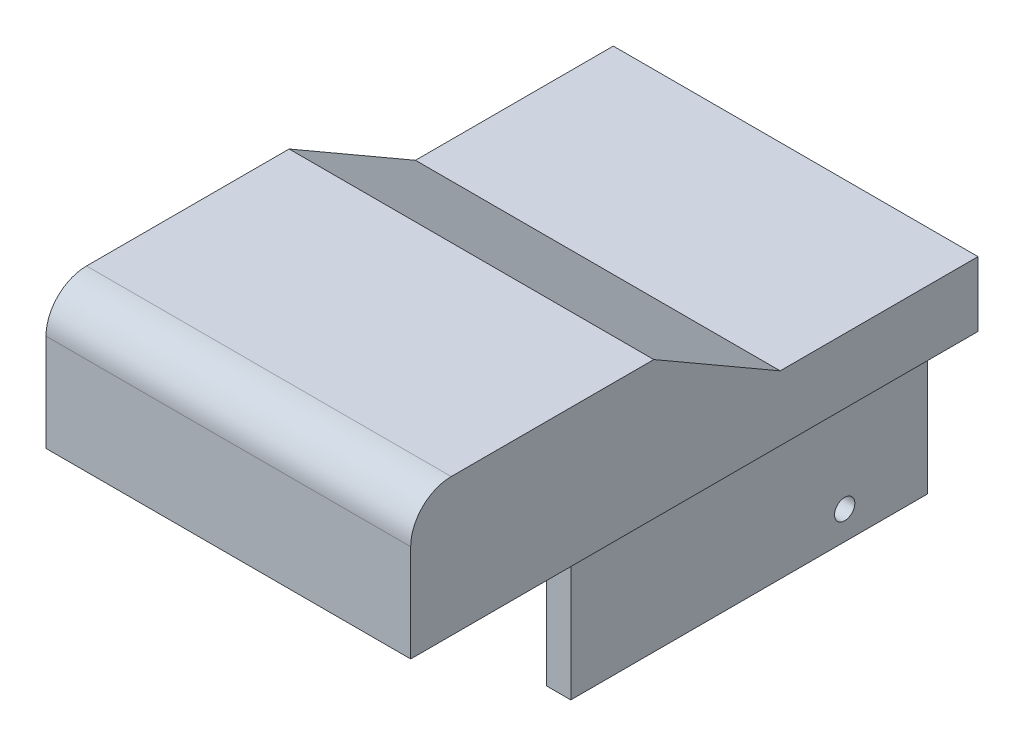
ISO-10303-21;
HEADER;
FILE_DESCRIPTION(('STEP AP214'),'2;1');
FILE_NAME('part.step','',(''),(''),'','','');
FILE_SCHEMA(('AUTOMOTIVE_DESIGN { 1 0 10303 214 1 1 1 1 }'));
ENDSEC;
DATA;
#1=APPLICATION_CONTEXT('core data for automotive mechanical design processes');
#2=APPLICATION_PROTOCOL_DEFINITION('international standard','automotive_design',2000,#1);
#3=PRODUCT_CONTEXT('',#1,'mechanical');
#4=PRODUCT('Part','Part','',(#3));
#5=PRODUCT_RELATED_PRODUCT_CATEGORY('part','',(#4));
#6=PRODUCT_DEFINITION_FORMATION('','',#4);
#7=PRODUCT_DEFINITION_CONTEXT('part definition',#1,'design');
#8=PRODUCT_DEFINITION('design','',#6,#7);
#9=PRODUCT_DEFINITION_SHAPE('','',#8);
#10=(LENGTH_UNIT() NAMED_UNIT(*) SI_UNIT(.MILLI.,.METRE.));
#11=(NAMED_UNIT(*) PLANE_ANGLE_UNIT() SI_UNIT($,.RADIAN.));
#12=(NAMED_UNIT(*) SI_UNIT($,.STERADIAN.) SOLID_ANGLE_UNIT());
#13=UNCERTAINTY_MEASURE_WITH_UNIT(LENGTH_MEASURE(1.E-05),#10,'distance_accuracy_value','');
#14=(GEOMETRIC_REPRESENTATION_CONTEXT(3) GLOBAL_UNCERTAINTY_ASSIGNED_CONTEXT((#13)) GLOBAL_UNIT_ASSIGNED_CONTEXT((#10,
#11,#12)) REPRESENTATION_CONTEXT('',''));
#15=CARTESIAN_POINT('',(0.,0.,0.));
#16=DIRECTION('',(0.,0.,1.));
#17=DIRECTION('',(1.,0.,0.));
#18=AXIS2_PLACEMENT_3D('',#15,#16,#17);
#19=CARTESIAN_POINT('',(22.5,-17.,-63.3184572681201));
#20=DIRECTION('',(0.,1.,0.));
#21=DIRECTION('',(0.,0.,1.));
#22=AXIS2_PLACEMENT_3D('',#19,#20,#21);
#23=PLANE('',#22);
#24=DIRECTION('',(0.,0.,1.));
#25=VECTOR('',#24,1.);
#26=CARTESIAN_POINT('',(-13.25,-17.,-70.));
#27=LINE('',#26,#25);
#28=CARTESIAN_POINT('',(-13.25,-17.,-70.));
#29=VERTEX_POINT('',#28);
#30=CARTESIAN_POINT('',(-13.25,-17.,-26.));
#31=VERTEX_POINT('',#30);
#32=EDGE_CURVE('E281',#29,#31,#27,.T.);
#33=ORIENTED_EDGE('',*,*,#32,.F.);
#34=DIRECTION('',(-1.,0.,0.));
#35=VECTOR('',#34,1.);
#36=CARTESIAN_POINT('',(22.5,-17.,-70.));
#37=LINE('',#36,#35);
#38=CARTESIAN_POINT('',(13.25,-17.,-70.));
#39=VERTEX_POINT('',#38);
#40=EDGE_CURVE('E163',#39,#29,#37,.T.);
#41=ORIENTED_EDGE('',*,*,#40,.F.);
#42=DIRECTION('',(0.,0.,-1.));
#43=VECTOR('',#42,1.);
#44=CARTESIAN_POINT('',(13.25,-17.,-70.));
#45=LINE('',#44,#43);
#46=CARTESIAN_POINT('',(13.25,-17.,-26.));
#47=VERTEX_POINT('',#46);
#48=EDGE_CURVE('E58',#47,#39,#45,.T.);
#49=ORIENTED_EDGE('',*,*,#48,.F.);
#50=DIRECTION('',(-1.,0.,0.));
#51=VECTOR('',#50,1.);
#52=CARTESIAN_POINT('',(13.25,-17.,-26.));
#53=LINE('',#52,#51);
#54=CARTESIAN_POINT('',(16.25,-17.,-26.));
#55=VERTEX_POINT('',#54);
#56=EDGE_CURVE('E175',#55,#47,#53,.T.);
#57=ORIENTED_EDGE('',*,*,#56,.F.);
#58=DIRECTION('',(0.,0.,1.));
#59=VECTOR('',#58,1.);
#60=CARTESIAN_POINT('',(16.25,-17.,-70.));
#61=LINE('',#60,#59);
#62=CARTESIAN_POINT('',(16.25,-17.,-70.));
#63=VERTEX_POINT('',#62);
#64=EDGE_CURVE('E165',#63,#55,#61,.T.);
#65=ORIENTED_EDGE('',*,*,#64,.F.);
#66=CARTESIAN_POINT('',(22.5,-17.,-70.));
#67=VERTEX_POINT('',#66);
#68=EDGE_CURVE('E234',#67,#63,#37,.T.);
#69=ORIENTED_EDGE('',*,*,#68,.F.);
#70=DIRECTION('',(0.,0.,-1.));
#71=VECTOR('',#70,1.);
#72=CARTESIAN_POINT('',(22.5,-17.,-63.3184572681201));
#73=LINE('',#72,#71);
#74=CARTESIAN_POINT('',(22.5,-17.,0.));
#75=VERTEX_POINT('',#74);
#76=EDGE_CURVE('E206',#75,#67,#73,.T.);
#77=ORIENTED_EDGE('',*,*,#76,.F.);
#78=DIRECTION('',(-1.,0.,0.));
#79=VECTOR('',#78,1.);
#80=CARTESIAN_POINT('',(22.5,-17.,0.));
#81=LINE('',#80,#79);
#82=CARTESIAN_POINT('',(-22.5,-17.,0.));
#83=VERTEX_POINT('',#82);
#84=EDGE_CURVE('E237',#75,#83,#81,.T.);
#85=ORIENTED_EDGE('',*,*,#84,.T.);
#86=DIRECTION('',(0.,0.,-1.));
#87=VECTOR('',#86,1.);
#88=CARTESIAN_POINT('',(-22.5,-17.,-63.3184572681201));
#89=LINE('',#88,#87);
#90=CARTESIAN_POINT('',(-22.5,-17.,-70.));
#91=VERTEX_POINT('',#90);
#92=EDGE_CURVE('E222',#83,#91,#89,.T.);
#93=ORIENTED_EDGE('',*,*,#92,.T.);
#94=CARTESIAN_POINT('',(-16.25,-17.,-70.));
#95=VERTEX_POINT('',#94);
#96=EDGE_CURVE('E233',#95,#91,#37,.T.);
#97=ORIENTED_EDGE('',*,*,#96,.F.);
#98=DIRECTION('',(0.,0.,-1.));
#99=VECTOR('',#98,1.);
#100=CARTESIAN_POINT('',(-16.25,-17.,-70.));
#101=LINE('',#100,#99);
#102=CARTESIAN_POINT('',(-16.25,-17.,-26.));
#103=VERTEX_POINT('',#102);
#104=EDGE_CURVE('E158',#103,#95,#101,.T.);
#105=ORIENTED_EDGE('',*,*,#104,.F.);
#106=DIRECTION('',(-1.,0.,0.));
#107=VECTOR('',#106,1.);
#108=CARTESIAN_POINT('',(-13.25,-17.,-26.));
#109=LINE('',#108,#107);
#110=EDGE_CURVE('E277',#31,#103,#109,.T.);
#111=ORIENTED_EDGE('',*,*,#110,.F.);
#112=EDGE_LOOP('',(#33,#41,#49,#57,#65,#69,#77,#85,#93,#97,#105,#111));
#113=FACE_BOUND('',#112,.T.);
#114=ADVANCED_FACE('F35',(#113),#23,.F.);
#115=CARTESIAN_POINT('',(22.5,0.,-30.));
#116=DIRECTION('',(0.,-0.866025403784442,0.499999999999994));
#117=DIRECTION('',(0.,-0.499999999999995,-0.866025403784442));
#118=AXIS2_PLACEMENT_3D('',#115,#116,#117);
#119=PLANE('',#118);
#120=DIRECTION('',(0.,0.499999999999994,0.866025403784442));
#121=VECTOR('',#120,1.);
#122=CARTESIAN_POINT('',(-22.5,0.,-30.));
#123=LINE('',#122,#121);
#124=CARTESIAN_POINT('',(-22.5,-9.,-45.5884572681201));
#125=VERTEX_POINT('',#124);
#126=CARTESIAN_POINT('',(-22.5,0.,-30.));
#127=VERTEX_POINT('',#126);
#128=EDGE_CURVE('E195',#125,#127,#123,.T.);
#129=ORIENTED_EDGE('',*,*,#128,.T.);
#130=DIRECTION('',(-1.,0.,0.));
#131=VECTOR('',#130,1.);
#132=CARTESIAN_POINT('',(22.5,0.,-30.));
#133=LINE('',#132,#131);
#134=CARTESIAN_POINT('',(22.5,0.,-30.));
#135=VERTEX_POINT('',#134);
#136=EDGE_CURVE('E11',#135,#127,#133,.T.);
#137=ORIENTED_EDGE('',*,*,#136,.F.);
#138=DIRECTION('',(0.,0.499999999999994,0.866025403784442));
#139=VECTOR('',#138,1.);
#140=CARTESIAN_POINT('',(22.5,0.,-30.));
#141=LINE('',#140,#139);
#142=CARTESIAN_POINT('',(22.5,-9.,-45.5884572681201));
#143=VERTEX_POINT('',#142);
#144=EDGE_CURVE('E196',#143,#135,#141,.T.);
#145=ORIENTED_EDGE('',*,*,#144,.F.);
#146=DIRECTION('',(-1.,0.,0.));
#147=VECTOR('',#146,1.);
#148=CARTESIAN_POINT('',(22.5,-9.,-45.5884572681201));
#149=LINE('',#148,#147);
#150=EDGE_CURVE('E212',#143,#125,#149,.T.);
#151=ORIENTED_EDGE('',*,*,#150,.T.);
#152=EDGE_LOOP('',(#129,#137,#145,#151));
#153=FACE_BOUND('',#152,.T.);
#154=ADVANCED_FACE('F37',(#153),#119,.F.);
#155=CARTESIAN_POINT('',(22.5,0.,-5.00000000000004));
#156=DIRECTION('',(0.,-1.,0.));
#157=DIRECTION('',(0.,0.,-1.));
#158=AXIS2_PLACEMENT_3D('',#155,#156,#157);
#159=PLANE('',#158);
#160=DIRECTION('',(0.,0.,1.));
#161=VECTOR('',#160,1.);
#162=CARTESIAN_POINT('',(-22.5,0.,-5.00000000000004));
#163=LINE('',#162,#161);
#164=CARTESIAN_POINT('',(-22.5,0.,-5.00000000000004));
#165=VERTEX_POINT('',#164);
#166=EDGE_CURVE('E215',#127,#165,#163,.T.);
#167=ORIENTED_EDGE('',*,*,#166,.T.);
#168=DIRECTION('',(-1.,0.,0.));
#169=VECTOR('',#168,1.);
#170=CARTESIAN_POINT('',(22.5,0.,-5.00000000000004));
#171=LINE('',#170,#169);
#172=CARTESIAN_POINT('',(22.5,0.,-5.00000000000004));
#173=VERTEX_POINT('',#172);
#174=EDGE_CURVE('E43',#173,#165,#171,.T.);
#175=ORIENTED_EDGE('',*,*,#174,.F.);
#176=DIRECTION('',(0.,0.,1.));
#177=VECTOR('',#176,1.);
#178=CARTESIAN_POINT('',(22.5,0.,-5.00000000000004));
#179=LINE('',#178,#177);
#180=EDGE_CURVE('E199',#135,#173,#179,.T.);
#181=ORIENTED_EDGE('',*,*,#180,.F.);
#182=ORIENTED_EDGE('',*,*,#136,.T.);
#183=EDGE_LOOP('',(#167,#175,#181,#182));
#184=FACE_BOUND('',#183,.T.);
#185=ADVANCED_FACE('F268',(#184),#159,.F.);
#186=CARTESIAN_POINT('',(22.5,-5.,-5.));
#187=DIRECTION('',(-1.,0.,0.));
#188=DIRECTION('',(0.,0.,1.));
#189=AXIS2_PLACEMENT_3D('',#186,#187,#188);
#190=CYLINDRICAL_SURFACE('',#189,5.);
#191=CARTESIAN_POINT('',(-22.5,-5.,-5.));
#192=DIRECTION('',(1.,0.,0.));
#193=DIRECTION('',(0.,0.,-1.));
#194=AXIS2_PLACEMENT_3D('',#191,#192,#193);
#195=CIRCLE('',#194,5.);
#196=CARTESIAN_POINT('',(-22.5,-5.00000000000003,0.));
#197=VERTEX_POINT('',#196);
#198=EDGE_CURVE('E217',#165,#197,#195,.T.);
#199=ORIENTED_EDGE('',*,*,#198,.T.);
#200=DIRECTION('',(-1.,0.,0.));
#201=VECTOR('',#200,1.);
#202=CARTESIAN_POINT('',(22.5,-5.00000000000003,0.));
#203=LINE('',#202,#201);
#204=CARTESIAN_POINT('',(22.5,-5.00000000000003,0.));
#205=VERTEX_POINT('',#204);
#206=EDGE_CURVE('E240',#205,#197,#203,.T.);
#207=ORIENTED_EDGE('',*,*,#206,.F.);
#208=CARTESIAN_POINT('',(22.5,-5.,-5.));
#209=DIRECTION('',(1.,0.,0.));
#210=DIRECTION('',(0.,0.,-1.));
#211=AXIS2_PLACEMENT_3D('',#208,#209,#210);
#212=CIRCLE('',#211,5.);
#213=EDGE_CURVE('E202',#173,#205,#212,.T.);
#214=ORIENTED_EDGE('',*,*,#213,.F.);
#215=ORIENTED_EDGE('',*,*,#174,.T.);
#216=EDGE_LOOP('',(#199,#207,#214,#215));
#217=FACE_BOUND('',#216,.T.);
#218=ADVANCED_FACE('F247',(#217),#190,.T.);
#219=CARTESIAN_POINT('',(22.5,-17.,0.));
#220=DIRECTION('',(0.,0.,-1.));
#221=DIRECTION('',(-1.,0.,0.));
#222=AXIS2_PLACEMENT_3D('',#219,#220,#221);
#223=PLANE('',#222);
#224=DIRECTION('',(0.,-1.,0.));
#225=VECTOR('',#224,1.);
#226=CARTESIAN_POINT('',(-22.5,-17.,0.));
#227=LINE('',#226,#225);
#228=EDGE_CURVE('E219',#197,#83,#227,.T.);
#229=ORIENTED_EDGE('',*,*,#228,.T.);
#230=ORIENTED_EDGE('',*,*,#84,.F.);
#231=DIRECTION('',(0.,-1.,0.));
#232=VECTOR('',#231,1.);
#233=CARTESIAN_POINT('',(22.5,-17.,0.));
#234=LINE('',#233,#232);
#235=EDGE_CURVE('E204',#205,#75,#234,.T.);
#236=ORIENTED_EDGE('',*,*,#235,.F.);
#237=ORIENTED_EDGE('',*,*,#206,.T.);
#238=EDGE_LOOP('',(#229,#230,#236,#237));
#239=FACE_BOUND('',#238,.T.);
#240=ADVANCED_FACE('F257',(#239),#223,.F.);
#241=CARTESIAN_POINT('',(22.5,-17.,-70.));
#242=DIRECTION('',(0.,0.,1.));
#243=DIRECTION('',(1.,0.,0.));
#244=AXIS2_PLACEMENT_3D('',#241,#242,#243);
#245=PLANE('',#244);
#246=DIRECTION('',(0.,1.,0.));
#247=VECTOR('',#246,1.);
#248=CARTESIAN_POINT('',(-22.5,-17.,-70.));
#249=LINE('',#248,#247);
#250=CARTESIAN_POINT('',(-22.5,-8.99999999999999,-70.));
#251=VERTEX_POINT('',#250);
#252=EDGE_CURVE('E225',#91,#251,#249,.T.);
#253=ORIENTED_EDGE('',*,*,#252,.T.);
#254=DIRECTION('',(-1.,0.,0.));
#255=VECTOR('',#254,1.);
#256=CARTESIAN_POINT('',(22.5,-8.99999999999999,-70.));
#257=LINE('',#256,#255);
#258=CARTESIAN_POINT('',(22.5,-8.99999999999999,-70.));
#259=VERTEX_POINT('',#258);
#260=EDGE_CURVE('E230',#259,#251,#257,.T.);
#261=ORIENTED_EDGE('',*,*,#260,.F.);
#262=DIRECTION('',(0.,1.,0.));
#263=VECTOR('',#262,1.);
#264=CARTESIAN_POINT('',(22.5,-17.,-70.));
#265=LINE('',#264,#263);
#266=EDGE_CURVE('E208',#67,#259,#265,.T.);
#267=ORIENTED_EDGE('',*,*,#266,.F.);
#268=ORIENTED_EDGE('',*,*,#68,.T.);
#269=DIRECTION('',(0.,1.,0.));
#270=VECTOR('',#269,1.);
#271=CARTESIAN_POINT('',(16.25,-37.5,-70.));
#272=LINE('',#271,#270);
#273=CARTESIAN_POINT('',(16.25,-37.5,-70.));
#274=VERTEX_POINT('',#273);
#275=EDGE_CURVE('E190',#274,#63,#272,.T.);
#276=ORIENTED_EDGE('',*,*,#275,.F.);
#277=DIRECTION('',(1.,0.,0.));
#278=VECTOR('',#277,1.);
#279=CARTESIAN_POINT('',(13.25,-37.5,-70.));
#280=LINE('',#279,#278);
#281=CARTESIAN_POINT('',(13.25,-37.5,-70.));
#282=VERTEX_POINT('',#281);
#283=EDGE_CURVE('E174',#282,#274,#280,.T.);
#284=ORIENTED_EDGE('',*,*,#283,.F.);
#285=DIRECTION('',(0.,1.,0.));
#286=VECTOR('',#285,1.);
#287=CARTESIAN_POINT('',(13.25,-37.5,-70.));
#288=LINE('',#287,#286);
#289=EDGE_CURVE('E193',#282,#39,#288,.T.);
#290=ORIENTED_EDGE('',*,*,#289,.T.);
#291=ORIENTED_EDGE('',*,*,#40,.T.);
#292=DIRECTION('',(0.,1.,0.));
#293=VECTOR('',#292,1.);
#294=CARTESIAN_POINT('',(-13.25,-37.5,-70.));
#295=LINE('',#294,#293);
#296=CARTESIAN_POINT('',(-13.25,-37.5,-70.));
#297=VERTEX_POINT('',#296);
#298=EDGE_CURVE('E146',#297,#29,#295,.T.);
#299=ORIENTED_EDGE('',*,*,#298,.F.);
#300=DIRECTION('',(1.,0.,0.));
#301=VECTOR('',#300,1.);
#302=CARTESIAN_POINT('',(-13.25,-37.5,-70.));
#303=LINE('',#302,#301);
#304=CARTESIAN_POINT('',(-16.25,-37.5,-70.));
#305=VERTEX_POINT('',#304);
#306=EDGE_CURVE('E153',#305,#297,#303,.T.);
#307=ORIENTED_EDGE('',*,*,#306,.F.);
#308=DIRECTION('',(0.,1.,0.));
#309=VECTOR('',#308,1.);
#310=CARTESIAN_POINT('',(-16.25,-37.5,-70.));
#311=LINE('',#310,#309);
#312=EDGE_CURVE('E50',#305,#95,#311,.T.);
#313=ORIENTED_EDGE('',*,*,#312,.T.);
#314=ORIENTED_EDGE('',*,*,#96,.T.);
#315=EDGE_LOOP('',(#253,#261,#267,#268,#276,#284,#290,#291,#299,#307,#313,#314));
#316=FACE_BOUND('',#315,.T.);
#317=ADVANCED_FACE('F161',(#316),#245,.F.);
#318=CARTESIAN_POINT('',(22.5,-8.99999999999999,-70.));
#319=DIRECTION('',(0.,-1.,0.));
#320=DIRECTION('',(0.,0.,-1.));
#321=AXIS2_PLACEMENT_3D('',#318,#319,#320);
#322=PLANE('',#321);
#323=DIRECTION('',(0.,0.,1.));
#324=VECTOR('',#323,1.);
#325=CARTESIAN_POINT('',(-22.5,-8.99999999999999,-70.));
#326=LINE('',#325,#324);
#327=EDGE_CURVE('E200',#251,#125,#326,.T.);
#328=ORIENTED_EDGE('',*,*,#327,.T.);
#329=ORIENTED_EDGE('',*,*,#150,.F.);
#330=DIRECTION('',(0.,0.,1.));
#331=VECTOR('',#330,1.);
#332=CARTESIAN_POINT('',(22.5,-8.99999999999999,-70.));
#333=LINE('',#332,#331);
#334=EDGE_CURVE('E210',#259,#143,#333,.T.);
#335=ORIENTED_EDGE('',*,*,#334,.F.);
#336=ORIENTED_EDGE('',*,*,#260,.T.);
#337=EDGE_LOOP('',(#328,#329,#335,#336));
#338=FACE_BOUND('',#337,.T.);
#339=ADVANCED_FACE('F273',(#338),#322,.F.);
#340=CARTESIAN_POINT('',(22.5,-5.,-5.));
#341=DIRECTION('',(1.,0.,0.));
#342=DIRECTION('',(0.,0.,-1.));
#343=AXIS2_PLACEMENT_3D('',#340,#341,#342);
#344=PLANE('',#343);
#345=ORIENTED_EDGE('',*,*,#144,.T.);
#346=ORIENTED_EDGE('',*,*,#180,.T.);
#347=ORIENTED_EDGE('',*,*,#213,.T.);
#348=ORIENTED_EDGE('',*,*,#235,.T.);
#349=ORIENTED_EDGE('',*,*,#76,.T.);
#350=ORIENTED_EDGE('',*,*,#266,.T.);
#351=ORIENTED_EDGE('',*,*,#334,.T.);
#352=EDGE_LOOP('',(#345,#346,#347,#348,#349,#350,#351));
#353=FACE_BOUND('',#352,.T.);
#354=ADVANCED_FACE('F264',(#353),#344,.T.);
#355=CARTESIAN_POINT('',(-22.5,-5.,-5.));
#356=DIRECTION('',(1.,0.,0.));
#357=DIRECTION('',(0.,0.,-1.));
#358=AXIS2_PLACEMENT_3D('',#355,#356,#357);
#359=PLANE('',#358);
#360=ORIENTED_EDGE('',*,*,#128,.F.);
#361=ORIENTED_EDGE('',*,*,#327,.F.);
#362=ORIENTED_EDGE('',*,*,#252,.F.);
#363=ORIENTED_EDGE('',*,*,#92,.F.);
#364=ORIENTED_EDGE('',*,*,#228,.F.);
#365=ORIENTED_EDGE('',*,*,#198,.F.);
#366=ORIENTED_EDGE('',*,*,#166,.F.);
#367=EDGE_LOOP('',(#360,#361,#362,#363,#364,#365,#366));
#368=FACE_BOUND('',#367,.T.);
#369=ADVANCED_FACE('F253',(#368),#359,.F.);
#370=CARTESIAN_POINT('',(13.25,-37.5,-70.));
#371=DIRECTION('',(1.,0.,0.));
#372=DIRECTION('',(0.,0.,-1.));
#373=AXIS2_PLACEMENT_3D('',#370,#371,#372);
#374=PLANE('',#373);
#375=CARTESIAN_POINT('',(13.25,-20.5,-39.5));
#376=DIRECTION('',(1.,0.,0.));
#377=DIRECTION('',(0.,0.,-1.));
#378=AXIS2_PLACEMENT_3D('',#375,#376,#377);
#379=CIRCLE('',#378,1.25);
#380=CARTESIAN_POINT('',(13.25,-20.5,-40.75));
#381=VERTEX_POINT('',#380);
#382=EDGE_CURVE('E306',#381,#381,#379,.T.);
#383=ORIENTED_EDGE('',*,*,#382,.T.);
#384=EDGE_LOOP('',(#383));
#385=FACE_BOUND('',#384,.T.);
#386=CARTESIAN_POINT('',(13.25,-34.,-59.8));
#387=DIRECTION('',(1.,0.,0.));
#388=DIRECTION('',(0.,0.,-1.));
#389=AXIS2_PLACEMENT_3D('',#386,#387,#388);
#390=CIRCLE('',#389,1.25);
#391=CARTESIAN_POINT('',(13.25,-34.,-61.05));
#392=VERTEX_POINT('',#391);
#393=EDGE_CURVE('E291',#392,#392,#390,.T.);
#394=ORIENTED_EDGE('',*,*,#393,.T.);
#395=EDGE_LOOP('',(#394));
#396=FACE_BOUND('',#395,.T.);
#397=ORIENTED_EDGE('',*,*,#48,.T.);
#398=ORIENTED_EDGE('',*,*,#289,.F.);
#399=DIRECTION('',(0.,0.,-1.));
#400=VECTOR('',#399,1.);
#401=CARTESIAN_POINT('',(13.25,-37.5,-70.));
#402=LINE('',#401,#400);
#403=CARTESIAN_POINT('',(13.25,-37.5,-26.));
#404=VERTEX_POINT('',#403);
#405=EDGE_CURVE('E171',#404,#282,#402,.T.);
#406=ORIENTED_EDGE('',*,*,#405,.F.);
#407=DIRECTION('',(0.,1.,0.));
#408=VECTOR('',#407,1.);
#409=CARTESIAN_POINT('',(13.25,-37.5,-26.));
#410=LINE('',#409,#408);
#411=EDGE_CURVE('E180',#404,#47,#410,.T.);
#412=ORIENTED_EDGE('',*,*,#411,.T.);
#413=EDGE_LOOP('',(#397,#398,#406,#412));
#414=FACE_BOUND('',#413,.T.);
#415=ADVANCED_FACE('F393',(#385,#396,#414),#374,.F.);
#416=CARTESIAN_POINT('',(16.25,-37.5,-70.));
#417=DIRECTION('',(-1.,0.,0.));
#418=DIRECTION('',(0.,0.,1.));
#419=AXIS2_PLACEMENT_3D('',#416,#417,#418);
#420=PLANE('',#419);
#421=CARTESIAN_POINT('',(16.25,-20.5,-39.5));
#422=DIRECTION('',(-1.,0.,0.));
#423=DIRECTION('',(0.,0.,1.));
#424=AXIS2_PLACEMENT_3D('',#421,#422,#423);
#425=CIRCLE('',#424,1.25);
#426=CARTESIAN_POINT('',(16.25,-20.5,-38.25));
#427=VERTEX_POINT('',#426);
#428=EDGE_CURVE('E309',#427,#427,#425,.T.);
#429=ORIENTED_EDGE('',*,*,#428,.T.);
#430=EDGE_LOOP('',(#429));
#431=FACE_BOUND('',#430,.T.);
#432=CARTESIAN_POINT('',(16.25,-34.,-59.8));
#433=DIRECTION('',(-1.,0.,0.));
#434=DIRECTION('',(0.,0.,1.));
#435=AXIS2_PLACEMENT_3D('',#432,#433,#434);
#436=CIRCLE('',#435,1.25);
#437=CARTESIAN_POINT('',(16.25,-34.,-58.55));
#438=VERTEX_POINT('',#437);
#439=EDGE_CURVE('E293',#438,#438,#436,.T.);
#440=ORIENTED_EDGE('',*,*,#439,.T.);
#441=EDGE_LOOP('',(#440));
#442=FACE_BOUND('',#441,.T.);
#443=ORIENTED_EDGE('',*,*,#64,.T.);
#444=DIRECTION('',(0.,1.,0.));
#445=VECTOR('',#444,1.);
#446=CARTESIAN_POINT('',(16.25,-37.5,-26.));
#447=LINE('',#446,#445);
#448=CARTESIAN_POINT('',(16.25,-37.5,-26.));
#449=VERTEX_POINT('',#448);
#450=EDGE_CURVE('E187',#449,#55,#447,.T.);
#451=ORIENTED_EDGE('',*,*,#450,.F.);
#452=DIRECTION('',(0.,0.,1.));
#453=VECTOR('',#452,1.);
#454=CARTESIAN_POINT('',(16.25,-37.5,-70.));
#455=LINE('',#454,#453);
#456=EDGE_CURVE('E177',#274,#449,#455,.T.);
#457=ORIENTED_EDGE('',*,*,#456,.F.);
#458=ORIENTED_EDGE('',*,*,#275,.T.);
#459=EDGE_LOOP('',(#443,#451,#457,#458));
#460=FACE_BOUND('',#459,.T.);
#461=ADVANCED_FACE('F400',(#431,#442,#460),#420,.F.);
#462=CARTESIAN_POINT('',(13.25,-37.5,-26.));
#463=DIRECTION('',(0.,0.,-1.));
#464=DIRECTION('',(-1.,0.,0.));
#465=AXIS2_PLACEMENT_3D('',#462,#463,#464);
#466=PLANE('',#465);
#467=ORIENTED_EDGE('',*,*,#56,.T.);
#468=ORIENTED_EDGE('',*,*,#411,.F.);
#469=DIRECTION('',(-1.,0.,0.));
#470=VECTOR('',#469,1.);
#471=CARTESIAN_POINT('',(13.25,-37.5,-26.));
#472=LINE('',#471,#470);
#473=EDGE_CURVE('E179',#449,#404,#472,.T.);
#474=ORIENTED_EDGE('',*,*,#473,.F.);
#475=ORIENTED_EDGE('',*,*,#450,.T.);
#476=EDGE_LOOP('',(#467,#468,#474,#475));
#477=FACE_BOUND('',#476,.T.);
#478=ADVANCED_FACE('F343',(#477),#466,.F.);
#479=CARTESIAN_POINT('',(0.,-37.5,0.));
#480=DIRECTION('',(0.,1.,0.));
#481=DIRECTION('',(0.,0.,1.));
#482=AXIS2_PLACEMENT_3D('',#479,#480,#481);
#483=PLANE('',#482);
#484=ORIENTED_EDGE('',*,*,#405,.T.);
#485=ORIENTED_EDGE('',*,*,#283,.T.);
#486=ORIENTED_EDGE('',*,*,#456,.T.);
#487=ORIENTED_EDGE('',*,*,#473,.T.);
#488=EDGE_LOOP('',(#484,#485,#486,#487));
#489=FACE_BOUND('',#488,.T.);
#490=ADVANCED_FACE('F335',(#489),#483,.F.);
#491=CARTESIAN_POINT('',(-13.25,-37.5,-70.));
#492=DIRECTION('',(-1.,0.,0.));
#493=DIRECTION('',(0.,0.,1.));
#494=AXIS2_PLACEMENT_3D('',#491,#492,#493);
#495=PLANE('',#494);
#496=CARTESIAN_POINT('',(-13.25,-20.5,-39.5));
#497=DIRECTION('',(-1.,0.,0.));
#498=DIRECTION('',(0.,0.,1.));
#499=AXIS2_PLACEMENT_3D('',#496,#497,#498);
#500=CIRCLE('',#499,1.25);
#501=CARTESIAN_POINT('',(-13.25,-20.5,-38.25));
#502=VERTEX_POINT('',#501);
#503=EDGE_CURVE('E312',#502,#502,#500,.T.);
#504=ORIENTED_EDGE('',*,*,#503,.T.);
#505=EDGE_LOOP('',(#504));
#506=FACE_BOUND('',#505,.T.);
#507=CARTESIAN_POINT('',(-13.25,-34.,-59.8));
#508=DIRECTION('',(-1.,0.,0.));
#509=DIRECTION('',(0.,0.,1.));
#510=AXIS2_PLACEMENT_3D('',#507,#508,#509);
#511=CIRCLE('',#510,1.25);
#512=CARTESIAN_POINT('',(-13.25,-34.,-58.55));
#513=VERTEX_POINT('',#512);
#514=EDGE_CURVE('E298',#513,#513,#511,.T.);
#515=ORIENTED_EDGE('',*,*,#514,.T.);
#516=EDGE_LOOP('',(#515));
#517=FACE_BOUND('',#516,.T.);
#518=ORIENTED_EDGE('',*,*,#32,.T.);
#519=DIRECTION('',(0.,1.,0.));
#520=VECTOR('',#519,1.);
#521=CARTESIAN_POINT('',(-13.25,-37.5,-26.));
#522=LINE('',#521,#520);
#523=CARTESIAN_POINT('',(-13.25,-37.5,-26.));
#524=VERTEX_POINT('',#523);
#525=EDGE_CURVE('E149',#524,#31,#522,.T.);
#526=ORIENTED_EDGE('',*,*,#525,.F.);
#527=DIRECTION('',(0.,0.,1.));
#528=VECTOR('',#527,1.);
#529=CARTESIAN_POINT('',(-13.25,-37.5,-70.));
#530=LINE('',#529,#528);
#531=EDGE_CURVE('E142',#297,#524,#530,.T.);
#532=ORIENTED_EDGE('',*,*,#531,.F.);
#533=ORIENTED_EDGE('',*,*,#298,.T.);
#534=EDGE_LOOP('',(#518,#526,#532,#533));
#535=FACE_BOUND('',#534,.T.);
#536=ADVANCED_FACE('F144',(#506,#517,#535),#495,.F.);
#537=CARTESIAN_POINT('',(-13.25,-37.5,-26.));
#538=DIRECTION('',(0.,0.,-1.));
#539=DIRECTION('',(-1.,0.,0.));
#540=AXIS2_PLACEMENT_3D('',#537,#538,#539);
#541=PLANE('',#540);
#542=ORIENTED_EDGE('',*,*,#110,.T.);
#543=DIRECTION('',(0.,1.,0.));
#544=VECTOR('',#543,1.);
#545=CARTESIAN_POINT('',(-16.25,-37.5,-26.));
#546=LINE('',#545,#544);
#547=CARTESIAN_POINT('',(-16.25,-37.5,-26.));
#548=VERTEX_POINT('',#547);
#549=EDGE_CURVE('E167',#548,#103,#546,.T.);
#550=ORIENTED_EDGE('',*,*,#549,.F.);
#551=DIRECTION('',(-1.,0.,0.));
#552=VECTOR('',#551,1.);
#553=CARTESIAN_POINT('',(-13.25,-37.5,-26.));
#554=LINE('',#553,#552);
#555=EDGE_CURVE('E152',#524,#548,#554,.T.);
#556=ORIENTED_EDGE('',*,*,#555,.F.);
#557=ORIENTED_EDGE('',*,*,#525,.T.);
#558=EDGE_LOOP('',(#542,#550,#556,#557));
#559=FACE_BOUND('',#558,.T.);
#560=ADVANCED_FACE('F288',(#559),#541,.F.);
#561=CARTESIAN_POINT('',(-16.25,-37.5,-70.));
#562=DIRECTION('',(1.,0.,0.));
#563=DIRECTION('',(0.,0.,-1.));
#564=AXIS2_PLACEMENT_3D('',#561,#562,#563);
#565=PLANE('',#564);
#566=CARTESIAN_POINT('',(-16.25,-20.5,-39.5));
#567=DIRECTION('',(-1.,0.,0.));
#568=DIRECTION('',(0.,0.,1.));
#569=AXIS2_PLACEMENT_3D('',#566,#567,#568);
#570=CIRCLE('',#569,1.25);
#571=CARTESIAN_POINT('',(-16.25,-20.5,-38.25));
#572=VERTEX_POINT('',#571);
#573=EDGE_CURVE('E315',#572,#572,#570,.T.);
#574=ORIENTED_EDGE('',*,*,#573,.F.);
#575=EDGE_LOOP('',(#574));
#576=FACE_BOUND('',#575,.T.);
#577=CARTESIAN_POINT('',(-16.25,-34.,-59.8));
#578=DIRECTION('',(-1.,0.,0.));
#579=DIRECTION('',(0.,0.,1.));
#580=AXIS2_PLACEMENT_3D('',#577,#578,#579);
#581=CIRCLE('',#580,1.25);
#582=CARTESIAN_POINT('',(-16.25,-34.,-58.55));
#583=VERTEX_POINT('',#582);
#584=EDGE_CURVE('E303',#583,#583,#581,.T.);
#585=ORIENTED_EDGE('',*,*,#584,.F.);
#586=EDGE_LOOP('',(#585));
#587=FACE_BOUND('',#586,.T.);
#588=ORIENTED_EDGE('',*,*,#104,.T.);
#589=ORIENTED_EDGE('',*,*,#312,.F.);
#590=DIRECTION('',(0.,0.,-1.));
#591=VECTOR('',#590,1.);
#592=CARTESIAN_POINT('',(-16.25,-37.5,-70.));
#593=LINE('',#592,#591);
#594=EDGE_CURVE('E157',#548,#305,#593,.T.);
#595=ORIENTED_EDGE('',*,*,#594,.F.);
#596=ORIENTED_EDGE('',*,*,#549,.T.);
#597=EDGE_LOOP('',(#588,#589,#595,#596));
#598=FACE_BOUND('',#597,.T.);
#599=ADVANCED_FACE('F286',(#576,#587,#598),#565,.F.);
#600=CARTESIAN_POINT('',(0.,-37.5,0.));
#601=DIRECTION('',(0.,1.,0.));
#602=DIRECTION('',(0.,0.,1.));
#603=AXIS2_PLACEMENT_3D('',#600,#601,#602);
#604=PLANE('',#603);
#605=ORIENTED_EDGE('',*,*,#306,.T.);
#606=ORIENTED_EDGE('',*,*,#531,.T.);
#607=ORIENTED_EDGE('',*,*,#555,.T.);
#608=ORIENTED_EDGE('',*,*,#594,.T.);
#609=EDGE_LOOP('',(#605,#606,#607,#608));
#610=FACE_BOUND('',#609,.T.);
#611=ADVANCED_FACE('F155',(#610),#604,.F.);
#612=CARTESIAN_POINT('',(22.5,-34.,-59.8));
#613=DIRECTION('',(-1.,0.,0.));
#614=DIRECTION('',(0.,0.,1.));
#615=AXIS2_PLACEMENT_3D('',#612,#613,#614);
#616=CYLINDRICAL_SURFACE('',#615,1.25);
#617=ORIENTED_EDGE('',*,*,#584,.T.);
#618=EDGE_LOOP('',(#617));
#619=FACE_BOUND('',#618,.T.);
#620=ORIENTED_EDGE('',*,*,#514,.F.);
#621=EDGE_LOOP('',(#620));
#622=FACE_BOUND('',#621,.T.);
#623=ADVANCED_FACE('F327',(#619,#622),#616,.F.);
#624=ORIENTED_EDGE('',*,*,#439,.F.);
#625=EDGE_LOOP('',(#624));
#626=FACE_BOUND('',#625,.T.);
#627=ORIENTED_EDGE('',*,*,#393,.F.);
#628=EDGE_LOOP('',(#627));
#629=FACE_BOUND('',#628,.T.);
#630=ADVANCED_FACE('F330',(#626,#629),#616,.F.);
#631=CARTESIAN_POINT('',(22.5,-20.5,-39.5));
#632=DIRECTION('',(-1.,0.,0.));
#633=DIRECTION('',(0.,0.,1.));
#634=AXIS2_PLACEMENT_3D('',#631,#632,#633);
#635=CYLINDRICAL_SURFACE('',#634,1.25);
#636=ORIENTED_EDGE('',*,*,#573,.T.);
#637=EDGE_LOOP('',(#636));
#638=FACE_BOUND('',#637,.T.);
#639=ORIENTED_EDGE('',*,*,#503,.F.);
#640=EDGE_LOOP('',(#639));
#641=FACE_BOUND('',#640,.T.);
#642=ADVANCED_FACE('F319',(#638,#641),#635,.F.);
#643=ORIENTED_EDGE('',*,*,#428,.F.);
#644=EDGE_LOOP('',(#643));
#645=FACE_BOUND('',#644,.T.);
#646=ORIENTED_EDGE('',*,*,#382,.F.);
#647=EDGE_LOOP('',(#646));
#648=FACE_BOUND('',#647,.T.);
#649=ADVANCED_FACE('F455',(#645,#648),#635,.F.);
#650=CLOSED_SHELL('',(#114,#154,#185,#218,#240,#317,#339,#354,#369,#415,#461,#478,#490,#536,
#560,#599,#611,#623,#630,#642,#649));
#651=MANIFOLD_SOLID_BREP('B2',#650);
#652=ADVANCED_BREP_SHAPE_REPRESENTATION('',(#18,#651),#14);
#653=SHAPE_DEFINITION_REPRESENTATION(#9,#652);
ENDSEC;
END-ISO-10303-21;
